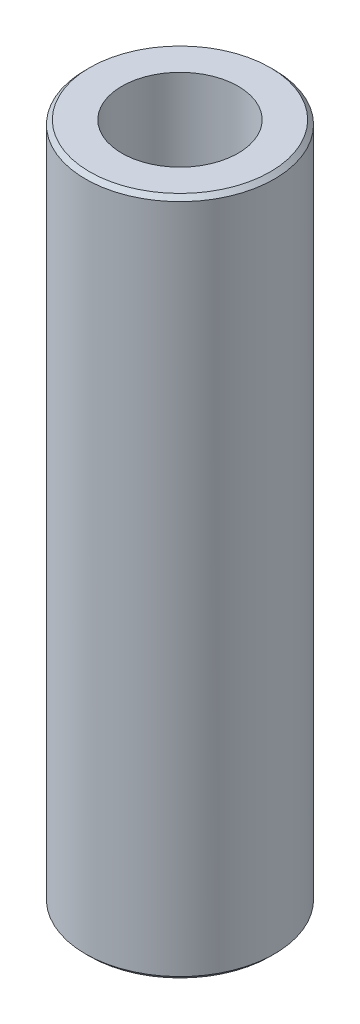
ISO-10303-21;
HEADER;
FILE_DESCRIPTION(('STEP AP214'),'2;1');
FILE_NAME('part.step','',(''),(''),'','','');
FILE_SCHEMA(('AUTOMOTIVE_DESIGN { 1 0 10303 214 1 1 1 1 }'));
ENDSEC;
DATA;
#1=APPLICATION_CONTEXT('core data for automotive mechanical design processes');
#2=APPLICATION_PROTOCOL_DEFINITION('international standard','automotive_design',2000,#1);
#3=PRODUCT_CONTEXT('',#1,'mechanical');
#4=PRODUCT('Part','Part','',(#3));
#5=PRODUCT_RELATED_PRODUCT_CATEGORY('part','',(#4));
#6=PRODUCT_DEFINITION_FORMATION('','',#4);
#7=PRODUCT_DEFINITION_CONTEXT('part definition',#1,'design');
#8=PRODUCT_DEFINITION('design','',#6,#7);
#9=PRODUCT_DEFINITION_SHAPE('','',#8);
#10=(LENGTH_UNIT() NAMED_UNIT(*) SI_UNIT(.MILLI.,.METRE.));
#11=(NAMED_UNIT(*) PLANE_ANGLE_UNIT() SI_UNIT($,.RADIAN.));
#12=(NAMED_UNIT(*) SI_UNIT($,.STERADIAN.) SOLID_ANGLE_UNIT());
#13=UNCERTAINTY_MEASURE_WITH_UNIT(LENGTH_MEASURE(1.E-05),#10,'distance_accuracy_value','');
#14=(GEOMETRIC_REPRESENTATION_CONTEXT(3) GLOBAL_UNCERTAINTY_ASSIGNED_CONTEXT((#13)) GLOBAL_UNIT_ASSIGNED_CONTEXT((#10,
#11,#12)) REPRESENTATION_CONTEXT('',''));
#15=CARTESIAN_POINT('',(0.,0.,0.));
#16=DIRECTION('',(0.,0.,1.));
#17=DIRECTION('',(1.,0.,0.));
#18=AXIS2_PLACEMENT_3D('',#15,#16,#17);
#19=CARTESIAN_POINT('',(0.,107.881599515713,0.));
#20=DIRECTION('',(0.,-1.,0.));
#21=DIRECTION('',(0.,0.,-1.));
#22=AXIS2_PLACEMENT_3D('',#19,#20,#21);
#23=CYLINDRICAL_SURFACE('',#22,15.);
#24=CARTESIAN_POINT('',(0.,107.220250959616,0.));
#25=DIRECTION('',(0.,1.,0.));
#26=DIRECTION('',(0.,0.,1.));
#27=AXIS2_PLACEMENT_3D('',#24,#25,#26);
#28=CIRCLE('',#27,15.);
#29=CARTESIAN_POINT('',(0.,107.220250959616,-15.));
#30=VERTEX_POINT('',#29);
#31=EDGE_CURVE('E50',#30,#30,#28,.F.);
#32=CARTESIAN_POINT('',(0.,0.661348556097355,0.));
#33=DIRECTION('',(0.,1.,0.));
#34=DIRECTION('',(0.,0.,1.));
#35=AXIS2_PLACEMENT_3D('',#32,#33,#34);
#36=CIRCLE('',#35,15.);
#37=CARTESIAN_POINT('',(0.,0.661348556097355,-15.));
#38=VERTEX_POINT('',#37);
#39=EDGE_CURVE('E51',#38,#38,#36,.T.);
#40=CARTESIAN_POINT('',(0.,107.220250959616,-15.));
#41=CARTESIAN_POINT('',(0.,106.110262392912,-15.));
#42=CARTESIAN_POINT('',(0.,105.000273826209,-15.));
#43=CARTESIAN_POINT('',(0.,102.780296692803,-15.));
#44=CARTESIAN_POINT('',(0.,101.670308126099,-15.));
#45=CARTESIAN_POINT('',(0.,99.4503309926926,-15.));
#46=CARTESIAN_POINT('',(0.,98.3403424259892,-15.));
#47=CARTESIAN_POINT('',(0.,96.1203652925826,-15.));
#48=CARTESIAN_POINT('',(0.,95.0103767258793,-15.));
#49=CARTESIAN_POINT('',(0.,92.7903995924727,-15.));
#50=CARTESIAN_POINT('',(0.,91.6804110257693,-15.));
#51=CARTESIAN_POINT('',(0.,89.4604338923627,-15.));
#52=CARTESIAN_POINT('',(0.,88.3504453256594,-15.));
#53=CARTESIAN_POINT('',(0.,86.1304681922528,-15.));
#54=CARTESIAN_POINT('',(0.,85.0204796255494,-15.));
#55=CARTESIAN_POINT('',(0.,82.8005024921428,-15.));
#56=CARTESIAN_POINT('',(0.,81.6905139254395,-15.));
#57=CARTESIAN_POINT('',(0.,79.4705367920328,-15.));
#58=CARTESIAN_POINT('',(0.,78.3605482253295,-15.));
#59=CARTESIAN_POINT('',(0.,76.1405710919229,-15.));
#60=CARTESIAN_POINT('',(0.,75.0305825252196,-15.));
#61=CARTESIAN_POINT('',(0.,72.810605391813,-15.));
#62=CARTESIAN_POINT('',(0.,71.7006168251096,-15.));
#63=CARTESIAN_POINT('',(0.,69.480639691703,-15.));
#64=CARTESIAN_POINT('',(0.,68.3706511249997,-15.));
#65=CARTESIAN_POINT('',(0.,66.1506739915931,-15.));
#66=CARTESIAN_POINT('',(0.,65.0406854248897,-15.));
#67=CARTESIAN_POINT('',(0.,62.8207082914831,-15.));
#68=CARTESIAN_POINT('',(0.,61.7107197247798,-15.));
#69=CARTESIAN_POINT('',(0.,59.4907425913731,-15.));
#70=CARTESIAN_POINT('',(0.,58.3807540246698,-15.));
#71=CARTESIAN_POINT('',(0.,56.1607768912632,-15.));
#72=CARTESIAN_POINT('',(0.,55.0507883245599,-15.));
#73=CARTESIAN_POINT('',(0.,52.8308111911533,-15.));
#74=CARTESIAN_POINT('',(0.,51.7208226244499,-15.));
#75=CARTESIAN_POINT('',(0.,49.5008454910433,-15.));
#76=CARTESIAN_POINT('',(0.,48.39085692434,-15.));
#77=CARTESIAN_POINT('',(0.,46.1708797909333,-15.));
#78=CARTESIAN_POINT('',(0.,45.06089122423,-15.));
#79=CARTESIAN_POINT('',(0.,42.8409140908234,-15.));
#80=CARTESIAN_POINT('',(0.,41.7309255241201,-15.));
#81=CARTESIAN_POINT('',(0.,39.5109483907134,-15.));
#82=CARTESIAN_POINT('',(0.,38.4009598240101,-15.));
#83=CARTESIAN_POINT('',(0.,36.1809826906035,-15.));
#84=CARTESIAN_POINT('',(0.,35.0709941239002,-15.));
#85=CARTESIAN_POINT('',(0.,32.8510169904936,-15.));
#86=CARTESIAN_POINT('',(0.,31.7410284237902,-15.));
#87=CARTESIAN_POINT('',(0.,29.5210512903836,-15.));
#88=CARTESIAN_POINT('',(0.,28.4110627236803,-15.));
#89=CARTESIAN_POINT('',(0.,26.1910855902736,-15.));
#90=CARTESIAN_POINT('',(0.,25.0810970235703,-15.));
#91=CARTESIAN_POINT('',(0.,22.8611198901637,-15.));
#92=CARTESIAN_POINT('',(0.,21.7511313234604,-15.));
#93=CARTESIAN_POINT('',(0.,19.5311541900537,-15.));
#94=CARTESIAN_POINT('',(0.,18.4211656233504,-15.));
#95=CARTESIAN_POINT('',(0.,16.2011884899438,-15.));
#96=CARTESIAN_POINT('',(0.,15.0911999232405,-15.));
#97=CARTESIAN_POINT('',(0.,12.8712227898338,-15.));
#98=CARTESIAN_POINT('',(0.,11.7612342231305,-15.));
#99=CARTESIAN_POINT('',(0.,9.5412570897239,-15.));
#100=CARTESIAN_POINT('',(0.,8.43126852302059,-15.));
#101=CARTESIAN_POINT('',(0.,6.21129138961396,-15.));
#102=CARTESIAN_POINT('',(0.,5.10130282291064,-15.));
#103=CARTESIAN_POINT('',(0.,2.88132568950399,-15.));
#104=CARTESIAN_POINT('',(0.,1.77133712280067,-15.));
#105=CARTESIAN_POINT('',(0.,0.661348556097355,-15.));
#106=B_SPLINE_CURVE_WITH_KNOTS('',3,(#40,#41,#42,#43,#44,#45,#46,#47,#48,#49,#50,#51,#52,#53,
#54,#55,#56,#57,#58,#59,#60,#61,#62,#63,#64,#65,#66,#67,#68,#69,#70,#71,#72,#73,#74,#75,#76,#77,
#78,#79,#80,#81,#82,#83,#84,#85,#86,#87,#88,#89,#90,#91,#92,#93,#94,#95,#96,#97,#98,#99,#100,
#101,#102,#103,#104,#105),.UNSPECIFIED.,.F.,.F.,(4,2,2,2,2,2,2,2,2,2,2,2,2,2,2,2,2,2,2,2,2,2,2,
2,2,2,2,2,2,2,2,2,4),(0.,3.32996570010996,6.65993140021991,9.98989710032985,13.3198628004398,
16.6498285005498,19.9797942006597,23.3097599007697,26.6397256008796,29.9696913009896,
33.2996570010995,36.6296227012095,39.9595884013194,43.2895541014294,46.6195198015393,
49.9494855016493,53.2794512017592,56.6094169018692,59.9393826019791,63.269348302089,
66.599314002199,69.929279702309,73.2592454024189,76.5892111025289,79.9191768026388,
83.2491425027488,86.5791082028587,89.9090739029687,93.2390396030786,96.5690053031886,
99.8989710032985,103.228936703408,106.558902403518),.UNSPECIFIED.);
#107=EDGE_CURVE('BSEAM39',#30,#38,#106,.T.);
#108=ORIENTED_EDGE('',*,*,#31,.T.);
#109=ORIENTED_EDGE('',*,*,#39,.T.);
#110=ORIENTED_EDGE('',*,*,#107,.T.);
#111=ORIENTED_EDGE('',*,*,#107,.F.);
#112=EDGE_LOOP('',(#108,#110,#109,#111));
#113=FACE_BOUND('',#112,.T.);
#114=ADVANCED_FACE('F39',(#113),#23,.T.);
#115=CARTESIAN_POINT('',(0.,107.881599515713,0.));
#116=DIRECTION('',(0.,1.,0.));
#117=DIRECTION('',(0.,0.,1.));
#118=AXIS2_PLACEMENT_3D('',#115,#116,#117);
#119=PLANE('',#118);
#120=CARTESIAN_POINT('',(0.,107.881599515713,0.));
#121=DIRECTION('',(0.,1.,0.));
#122=DIRECTION('',(0.,0.,1.));
#123=AXIS2_PLACEMENT_3D('',#120,#121,#122);
#124=CIRCLE('',#123,14.3386514439027);
#125=CARTESIAN_POINT('',(0.,107.881599515713,14.3386514439027));
#126=VERTEX_POINT('',#125);
#127=EDGE_CURVE('E54',#126,#126,#124,.T.);
#128=ORIENTED_EDGE('',*,*,#127,.T.);
#129=EDGE_LOOP('',(#128));
#130=FACE_BOUND('',#129,.T.);
#131=CARTESIAN_POINT('',(0.,107.881599515713,0.));
#132=DIRECTION('',(0.,1.,0.));
#133=DIRECTION('',(0.,0.,1.));
#134=AXIS2_PLACEMENT_3D('',#131,#132,#133);
#135=CIRCLE('',#134,9.22990523269587);
#136=CARTESIAN_POINT('',(0.,107.881599515713,-9.22990523269587));
#137=VERTEX_POINT('',#136);
#138=EDGE_CURVE('E58',#137,#137,#135,.T.);
#139=ORIENTED_EDGE('',*,*,#138,.F.);
#140=EDGE_LOOP('',(#139));
#141=FACE_BOUND('',#140,.T.);
#142=ADVANCED_FACE('F69',(#130,#141),#119,.T.);
#143=CARTESIAN_POINT('',(0.,0.,0.));
#144=DIRECTION('',(0.,1.,0.));
#145=DIRECTION('',(0.,0.,1.));
#146=AXIS2_PLACEMENT_3D('',#143,#144,#145);
#147=PLANE('',#146);
#148=CARTESIAN_POINT('',(0.,0.,0.));
#149=DIRECTION('',(0.,1.,0.));
#150=DIRECTION('',(0.,0.,1.));
#151=AXIS2_PLACEMENT_3D('',#148,#149,#150);
#152=CIRCLE('',#151,14.3386514439026);
#153=CARTESIAN_POINT('',(0.,0.,14.3386514439026));
#154=VERTEX_POINT('',#153);
#155=EDGE_CURVE('E10',#154,#154,#152,.F.);
#156=ORIENTED_EDGE('',*,*,#155,.T.);
#157=EDGE_LOOP('',(#156));
#158=FACE_BOUND('',#157,.T.);
#159=CARTESIAN_POINT('',(0.,0.,0.));
#160=DIRECTION('',(0.,1.,0.));
#161=DIRECTION('',(0.,0.,1.));
#162=AXIS2_PLACEMENT_3D('',#159,#160,#161);
#163=CIRCLE('',#162,9.22990523269587);
#164=CARTESIAN_POINT('',(0.,0.,-9.22990523269587));
#165=VERTEX_POINT('',#164);
#166=EDGE_CURVE('E63',#165,#165,#163,.T.);
#167=ORIENTED_EDGE('',*,*,#166,.T.);
#168=EDGE_LOOP('',(#167));
#169=FACE_BOUND('',#168,.T.);
#170=ADVANCED_FACE('F75',(#158,#169),#147,.F.);
#171=CARTESIAN_POINT('',(0.,107.881599515713,0.));
#172=DIRECTION('',(0.,-1.,0.));
#173=DIRECTION('',(0.,0.,-1.));
#174=AXIS2_PLACEMENT_3D('',#171,#172,#173);
#175=CYLINDRICAL_SURFACE('',#174,9.22990523269587);
#176=CARTESIAN_POINT('',(0.,107.881599515713,-9.22990523269587));
#177=CARTESIAN_POINT('',(0.,106.757832854091,-9.22990523269587));
#178=CARTESIAN_POINT('',(0.,105.634066192469,-9.22990523269587));
#179=CARTESIAN_POINT('',(0.,103.386532869225,-9.22990523269587));
#180=CARTESIAN_POINT('',(0.,102.262766207603,-9.22990523269587));
#181=CARTESIAN_POINT('',(0.,100.015232884359,-9.22990523269587));
#182=CARTESIAN_POINT('',(0.,98.891466222737,-9.22990523269587));
#183=CARTESIAN_POINT('',(0.,96.6439328994929,-9.22990523269587));
#184=CARTESIAN_POINT('',(0.,95.5201662378709,-9.22990523269587));
#185=CARTESIAN_POINT('',(0.,93.2726329146269,-9.22990523269587));
#186=CARTESIAN_POINT('',(0.,92.1488662530049,-9.22990523269587));
#187=CARTESIAN_POINT('',(0.,89.9013329297609,-9.22990523269587));
#188=CARTESIAN_POINT('',(0.,88.7775662681389,-9.22990523269587));
#189=CARTESIAN_POINT('',(0.,86.5300329448948,-9.22990523269587));
#190=CARTESIAN_POINT('',(0.,85.4062662832728,-9.22990523269587));
#191=CARTESIAN_POINT('',(0.,83.1587329600288,-9.22990523269587));
#192=CARTESIAN_POINT('',(0.,82.0349662984068,-9.22990523269587));
#193=CARTESIAN_POINT('',(0.,79.7874329751628,-9.22990523269587));
#194=CARTESIAN_POINT('',(0.,78.6636663135408,-9.22990523269587));
#195=CARTESIAN_POINT('',(0.,76.4161329902967,-9.22990523269587));
#196=CARTESIAN_POINT('',(0.,75.2923663286747,-9.22990523269587));
#197=CARTESIAN_POINT('',(0.,73.0448330054307,-9.22990523269587));
#198=CARTESIAN_POINT('',(0.,71.9210663438087,-9.22990523269587));
#199=CARTESIAN_POINT('',(0.,69.6735330205647,-9.22990523269587));
#200=CARTESIAN_POINT('',(0.,68.5497663589426,-9.22990523269587));
#201=CARTESIAN_POINT('',(0.,66.3022330356986,-9.22990523269587));
#202=CARTESIAN_POINT('',(0.,65.1784663740766,-9.22990523269587));
#203=CARTESIAN_POINT('',(0.,62.9309330508326,-9.22990523269587));
#204=CARTESIAN_POINT('',(0.,61.8071663892106,-9.22990523269587));
#205=CARTESIAN_POINT('',(0.,59.5596330659666,-9.22990523269587));
#206=CARTESIAN_POINT('',(0.,58.4358664043446,-9.22990523269587));
#207=CARTESIAN_POINT('',(0.,56.1883330811005,-9.22990523269587));
#208=CARTESIAN_POINT('',(0.,55.0645664194785,-9.22990523269587));
#209=CARTESIAN_POINT('',(0.,52.8170330962345,-9.22990523269587));
#210=CARTESIAN_POINT('',(0.,51.6932664346125,-9.22990523269587));
#211=CARTESIAN_POINT('',(0.,49.4457331113685,-9.22990523269587));
#212=CARTESIAN_POINT('',(0.,48.3219664497465,-9.22990523269587));
#213=CARTESIAN_POINT('',(0.,46.0744331265024,-9.22990523269587));
#214=CARTESIAN_POINT('',(0.,44.9506664648804,-9.22990523269587));
#215=CARTESIAN_POINT('',(0.,42.7031331416364,-9.22990523269587));
#216=CARTESIAN_POINT('',(0.,41.5793664800144,-9.22990523269587));
#217=CARTESIAN_POINT('',(0.,39.3318331567704,-9.22990523269587));
#218=CARTESIAN_POINT('',(0.,38.2080664951484,-9.22990523269587));
#219=CARTESIAN_POINT('',(0.,35.9605331719043,-9.22990523269587));
#220=CARTESIAN_POINT('',(0.,34.8367665102823,-9.22990523269587));
#221=CARTESIAN_POINT('',(0.,32.5892331870383,-9.22990523269587));
#222=CARTESIAN_POINT('',(0.,31.4654665254163,-9.22990523269587));
#223=CARTESIAN_POINT('',(0.,29.2179332021723,-9.22990523269587));
#224=CARTESIAN_POINT('',(0.,28.0941665405503,-9.22990523269587));
#225=CARTESIAN_POINT('',(0.,25.8466332173062,-9.22990523269587));
#226=CARTESIAN_POINT('',(0.,24.7228665556842,-9.22990523269587));
#227=CARTESIAN_POINT('',(0.,22.4753332324402,-9.22990523269587));
#228=CARTESIAN_POINT('',(0.,21.3515665708182,-9.22990523269587));
#229=CARTESIAN_POINT('',(0.,19.1040332475742,-9.22990523269587));
#230=CARTESIAN_POINT('',(0.,17.9802665859522,-9.22990523269587));
#231=CARTESIAN_POINT('',(0.,15.7327332627081,-9.22990523269587));
#232=CARTESIAN_POINT('',(0.,14.6089666010861,-9.22990523269587));
#233=CARTESIAN_POINT('',(0.,12.3614332778421,-9.22990523269587));
#234=CARTESIAN_POINT('',(0.,11.2376666162201,-9.22990523269587));
#235=CARTESIAN_POINT('',(0.,8.99013329297608,-9.22990523269587));
#236=CARTESIAN_POINT('',(0.,7.86636663135406,-9.22990523269587));
#237=CARTESIAN_POINT('',(0.,5.61883330811004,-9.22990523269587));
#238=CARTESIAN_POINT('',(0.,4.49506664648803,-9.22990523269587));
#239=CARTESIAN_POINT('',(0.,2.24753332324401,-9.22990523269587));
#240=CARTESIAN_POINT('',(0.,1.123766661622,-9.22990523269587));
#241=CARTESIAN_POINT('',(0.,0.,-9.22990523269587));
#242=B_SPLINE_CURVE_WITH_KNOTS('',3,(#176,#177,#178,#179,#180,#181,#182,#183,#184,#185,#186,
#187,#188,#189,#190,#191,#192,#193,#194,#195,#196,#197,#198,#199,#200,#201,#202,#203,#204,#205,
#206,#207,#208,#209,#210,#211,#212,#213,#214,#215,#216,#217,#218,#219,#220,#221,#222,#223,#224,
#225,#226,#227,#228,#229,#230,#231,#232,#233,#234,#235,#236,#237,#238,#239,#240,#241),
.UNSPECIFIED.,.F.,.F.,(4,2,2,2,2,2,2,2,2,2,2,2,2,2,2,2,2,2,2,2,2,2,2,2,2,2,2,2,2,2,2,2,4),(0.,
3.37129998486604,6.74259996973207,10.1138999545981,13.4851999394641,16.8564999243302,
20.2277999091962,23.5990998940622,26.9703998789283,30.3416998637943,33.7129998486603,
37.0842998335264,40.4555998183924,43.8268998032584,47.1981997881245,50.5694997729905,
53.9407997578565,57.3120997427226,60.6833997275886,64.0546997124546,67.4259996973207,
70.7972996821867,74.1685996670527,77.5398996519188,80.9111996367848,84.2824996216508,
87.6537996065169,91.0250995913829,94.3963995762489,97.767699561115,101.138999545981,
104.510299530847,107.881599515713),.UNSPECIFIED.);
#243=EDGE_CURVE('BSEAM70',#137,#165,#242,.T.);
#244=ORIENTED_EDGE('',*,*,#138,.T.);
#245=ORIENTED_EDGE('',*,*,#166,.F.);
#246=ORIENTED_EDGE('',*,*,#243,.T.);
#247=ORIENTED_EDGE('',*,*,#243,.F.);
#248=EDGE_LOOP('',(#244,#246,#245,#247));
#249=FACE_BOUND('',#248,.T.);
#250=ADVANCED_FACE('F70',(#249),#175,.F.);
#251=CARTESIAN_POINT('',(0.,107.881599515713,0.));
#252=DIRECTION('',(0.,-1.,0.));
#253=DIRECTION('',(0.,0.,-1.));
#254=AXIS2_PLACEMENT_3D('',#251,#252,#253);
#255=CONICAL_SURFACE('',#254,14.3386514439027,0.78539816339745);
#256=ORIENTED_EDGE('',*,*,#31,.F.);
#257=EDGE_LOOP('',(#256));
#258=FACE_BOUND('',#257,.T.);
#259=ORIENTED_EDGE('',*,*,#127,.F.);
#260=EDGE_LOOP('',(#259));
#261=FACE_BOUND('',#260,.T.);
#262=ADVANCED_FACE('F81',(#258,#261),#255,.T.);
#263=CARTESIAN_POINT('',(0.,0.661348556097355,0.));
#264=DIRECTION('',(0.,1.,0.));
#265=DIRECTION('',(0.,0.,1.));
#266=AXIS2_PLACEMENT_3D('',#263,#264,#265);
#267=CONICAL_SURFACE('',#266,15.,0.785398163397451);
#268=ORIENTED_EDGE('',*,*,#155,.F.);
#269=EDGE_LOOP('',(#268));
#270=FACE_BOUND('',#269,.T.);
#271=ORIENTED_EDGE('',*,*,#39,.F.);
#272=EDGE_LOOP('',(#271));
#273=FACE_BOUND('',#272,.T.);
#274=ADVANCED_FACE('F45',(#270,#273),#267,.T.);
#275=CLOSED_SHELL('',(#114,#142,#170,#250,#262,#274));
#276=MANIFOLD_SOLID_BREP('B2',#275);
#277=ADVANCED_BREP_SHAPE_REPRESENTATION('',(#18,#276),#14);
#278=SHAPE_DEFINITION_REPRESENTATION(#9,#277);
ENDSEC;
END-ISO-10303-21;
